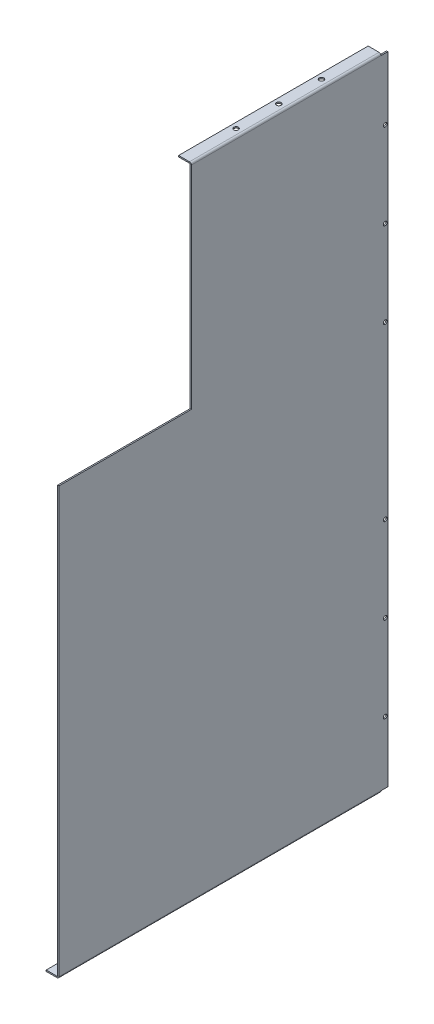
ISO-10303-21;
HEADER;
FILE_DESCRIPTION(('STEP AP214'),'2;1');
FILE_NAME('part.step','',(''),(''),'','','');
FILE_SCHEMA(('AUTOMOTIVE_DESIGN { 1 0 10303 214 1 1 1 1 }'));
ENDSEC;
DATA;
#1=APPLICATION_CONTEXT('core data for automotive mechanical design processes');
#2=APPLICATION_PROTOCOL_DEFINITION('international standard','automotive_design',2000,#1);
#3=PRODUCT_CONTEXT('',#1,'mechanical');
#4=PRODUCT('Part','Part','',(#3));
#5=PRODUCT_RELATED_PRODUCT_CATEGORY('part','',(#4));
#6=PRODUCT_DEFINITION_FORMATION('','',#4);
#7=PRODUCT_DEFINITION_CONTEXT('part definition',#1,'design');
#8=PRODUCT_DEFINITION('design','',#6,#7);
#9=PRODUCT_DEFINITION_SHAPE('','',#8);
#10=(LENGTH_UNIT() NAMED_UNIT(*) SI_UNIT(.MILLI.,.METRE.));
#11=(NAMED_UNIT(*) PLANE_ANGLE_UNIT() SI_UNIT($,.RADIAN.));
#12=(NAMED_UNIT(*) SI_UNIT($,.STERADIAN.) SOLID_ANGLE_UNIT());
#13=UNCERTAINTY_MEASURE_WITH_UNIT(LENGTH_MEASURE(1.E-05),#10,'distance_accuracy_value','');
#14=(GEOMETRIC_REPRESENTATION_CONTEXT(3) GLOBAL_UNCERTAINTY_ASSIGNED_CONTEXT((#13)) GLOBAL_UNIT_ASSIGNED_CONTEXT((#10,
#11,#12)) REPRESENTATION_CONTEXT('',''));
#15=CARTESIAN_POINT('',(0.,0.,0.));
#16=DIRECTION('',(0.,0.,1.));
#17=DIRECTION('',(1.,0.,0.));
#18=AXIS2_PLACEMENT_3D('',#15,#16,#17);
#19=CARTESIAN_POINT('',(1.5,0.,385.));
#20=DIRECTION('',(-1.,0.,0.));
#21=DIRECTION('',(0.,0.,1.));
#22=AXIS2_PLACEMENT_3D('',#19,#20,#21);
#23=PLANE('',#22);
#24=CARTESIAN_POINT('',(1.5,175.,3.));
#25=DIRECTION('',(1.,0.,0.));
#26=DIRECTION('',(0.,0.,-1.));
#27=AXIS2_PLACEMENT_3D('',#24,#25,#26);
#28=CIRCLE('',#27,2.25);
#29=CARTESIAN_POINT('',(1.5,175.,0.749999999999998));
#30=VERTEX_POINT('',#29);
#31=EDGE_CURVE('E387',#30,#30,#28,.T.);
#32=ORIENTED_EDGE('',*,*,#31,.F.);
#33=EDGE_LOOP('',(#32));
#34=FACE_BOUND('',#33,.T.);
#35=CARTESIAN_POINT('',(1.5,275.,3.));
#36=DIRECTION('',(1.,0.,0.));
#37=DIRECTION('',(0.,0.,-1.));
#38=AXIS2_PLACEMENT_3D('',#35,#36,#37);
#39=CIRCLE('',#38,2.25);
#40=CARTESIAN_POINT('',(1.5,275.,0.749999999999998));
#41=VERTEX_POINT('',#40);
#42=EDGE_CURVE('E716',#41,#41,#39,.T.);
#43=ORIENTED_EDGE('',*,*,#42,.F.);
#44=EDGE_LOOP('',(#43));
#45=FACE_BOUND('',#44,.T.);
#46=CARTESIAN_POINT('',(1.5,475.,3.));
#47=DIRECTION('',(1.,0.,0.));
#48=DIRECTION('',(0.,0.,1.));
#49=AXIS2_PLACEMENT_3D('',#46,#47,#48);
#50=CIRCLE('',#49,2.25);
#51=CARTESIAN_POINT('',(1.5,475.,5.25));
#52=VERTEX_POINT('',#51);
#53=EDGE_CURVE('E719',#52,#52,#50,.T.);
#54=ORIENTED_EDGE('',*,*,#53,.F.);
#55=EDGE_LOOP('',(#54));
#56=FACE_BOUND('',#55,.T.);
#57=CARTESIAN_POINT('',(1.5,575.,3.));
#58=DIRECTION('',(1.,0.,0.));
#59=DIRECTION('',(0.,0.,1.));
#60=AXIS2_PLACEMENT_3D('',#57,#58,#59);
#61=CIRCLE('',#60,2.24999999999998);
#62=CARTESIAN_POINT('',(1.5,575.,5.24999999999999));
#63=VERTEX_POINT('',#62);
#64=EDGE_CURVE('E724',#63,#63,#61,.T.);
#65=ORIENTED_EDGE('',*,*,#64,.F.);
#66=EDGE_LOOP('',(#65));
#67=FACE_BOUND('',#66,.T.);
#68=CARTESIAN_POINT('',(1.5,675.,3.));
#69=DIRECTION('',(1.,0.,0.));
#70=DIRECTION('',(0.,0.,1.));
#71=AXIS2_PLACEMENT_3D('',#68,#69,#70);
#72=CIRCLE('',#71,2.24999999999998);
#73=CARTESIAN_POINT('',(1.5,675.,5.24999999999999));
#74=VERTEX_POINT('',#73);
#75=EDGE_CURVE('E726',#74,#74,#72,.T.);
#76=ORIENTED_EDGE('',*,*,#75,.F.);
#77=EDGE_LOOP('',(#76));
#78=FACE_BOUND('',#77,.T.);
#79=CARTESIAN_POINT('',(1.5,75.,3.));
#80=DIRECTION('',(1.,0.,0.));
#81=DIRECTION('',(0.,0.,-1.));
#82=AXIS2_PLACEMENT_3D('',#79,#80,#81);
#83=CIRCLE('',#82,2.25);
#84=CARTESIAN_POINT('',(1.5,75.,0.749999999999999));
#85=VERTEX_POINT('',#84);
#86=EDGE_CURVE('E220',#85,#85,#83,.T.);
#87=ORIENTED_EDGE('',*,*,#86,.F.);
#88=EDGE_LOOP('',(#87));
#89=FACE_BOUND('',#88,.T.);
#90=DIRECTION('',(0.,0.,-1.));
#91=VECTOR('',#90,1.);
#92=CARTESIAN_POINT('',(1.5,500.,385.));
#93=LINE('',#92,#91);
#94=CARTESIAN_POINT('',(1.5,500.,385.));
#95=VERTEX_POINT('',#94);
#96=CARTESIAN_POINT('',(1.5,500.,230.));
#97=VERTEX_POINT('',#96);
#98=EDGE_CURVE('E209',#95,#97,#93,.T.);
#99=ORIENTED_EDGE('',*,*,#98,.F.);
#100=DIRECTION('',(0.,1.,0.));
#101=VECTOR('',#100,1.);
#102=CARTESIAN_POINT('',(1.5,0.,385.));
#103=LINE('',#102,#101);
#104=CARTESIAN_POINT('',(1.5,2.2366,385.));
#105=VERTEX_POINT('',#104);
#106=EDGE_CURVE('E363',#105,#95,#103,.T.);
#107=ORIENTED_EDGE('',*,*,#106,.F.);
#108=DIRECTION('',(0.,0.,1.));
#109=VECTOR('',#108,1.);
#110=CARTESIAN_POINT('',(1.5,2.2366,385.));
#111=LINE('',#110,#109);
#112=CARTESIAN_POINT('',(1.5,2.2366,8.00000000000001));
#113=VERTEX_POINT('',#112);
#114=EDGE_CURVE('E325',#105,#113,#111,.F.);
#115=ORIENTED_EDGE('',*,*,#114,.T.);
#116=DIRECTION('',(0.,0.,1.));
#117=VECTOR('',#116,1.);
#118=CARTESIAN_POINT('',(1.5,2.2366,385.));
#119=LINE('',#118,#117);
#120=CARTESIAN_POINT('',(1.5,2.2366,0.));
#121=VERTEX_POINT('',#120);
#122=EDGE_CURVE('E271',#113,#121,#119,.F.);
#123=ORIENTED_EDGE('',*,*,#122,.T.);
#124=DIRECTION('',(0.,1.,0.));
#125=VECTOR('',#124,1.);
#126=CARTESIAN_POINT('',(1.5,0.,0.));
#127=LINE('',#126,#125);
#128=CARTESIAN_POINT('',(1.5,747.7634,0.));
#129=VERTEX_POINT('',#128);
#130=EDGE_CURVE('E362',#121,#129,#127,.T.);
#131=ORIENTED_EDGE('',*,*,#130,.T.);
#132=DIRECTION('',(0.,0.,-1.));
#133=VECTOR('',#132,1.);
#134=CARTESIAN_POINT('',(1.5,747.7634,0.));
#135=LINE('',#134,#133);
#136=CARTESIAN_POINT('',(1.50000000000007,747.7634,7.99999999999999));
#137=VERTEX_POINT('',#136);
#138=EDGE_CURVE('E353',#129,#137,#135,.F.);
#139=ORIENTED_EDGE('',*,*,#138,.T.);
#140=CARTESIAN_POINT('',(1.5,747.7634,230.));
#141=VERTEX_POINT('',#140);
#142=EDGE_CURVE('E357',#137,#141,#135,.F.);
#143=ORIENTED_EDGE('',*,*,#142,.T.);
#144=DIRECTION('',(0.,-1.,0.));
#145=VECTOR('',#144,1.);
#146=CARTESIAN_POINT('',(1.5,0.,230.));
#147=LINE('',#146,#145);
#148=EDGE_CURVE('E268',#141,#97,#147,.T.);
#149=ORIENTED_EDGE('',*,*,#148,.T.);
#150=EDGE_LOOP('',(#99,#107,#115,#123,#131,#139,#143,#149));
#151=FACE_BOUND('',#150,.T.);
#152=ADVANCED_FACE('F77',(#34,#45,#56,#67,#78,#89,#151),#23,.F.);
#153=CARTESIAN_POINT('',(0.,0.,385.));
#154=DIRECTION('',(-1.,0.,0.));
#155=DIRECTION('',(0.,0.,1.));
#156=AXIS2_PLACEMENT_3D('',#153,#154,#155);
#157=PLANE('',#156);
#158=CARTESIAN_POINT('',(0.,175.,3.));
#159=DIRECTION('',(-1.,0.,0.));
#160=DIRECTION('',(0.,0.,1.));
#161=AXIS2_PLACEMENT_3D('',#158,#159,#160);
#162=CIRCLE('',#161,2.25);
#163=CARTESIAN_POINT('',(0.,175.,5.25));
#164=VERTEX_POINT('',#163);
#165=EDGE_CURVE('E80',#164,#164,#162,.T.);
#166=ORIENTED_EDGE('',*,*,#165,.F.);
#167=EDGE_LOOP('',(#166));
#168=FACE_BOUND('',#167,.T.);
#169=CARTESIAN_POINT('',(0.,275.,3.));
#170=DIRECTION('',(-1.,0.,0.));
#171=DIRECTION('',(0.,0.,1.));
#172=AXIS2_PLACEMENT_3D('',#169,#170,#171);
#173=CIRCLE('',#172,2.25);
#174=CARTESIAN_POINT('',(0.,275.,5.25));
#175=VERTEX_POINT('',#174);
#176=EDGE_CURVE('E392',#175,#175,#173,.T.);
#177=ORIENTED_EDGE('',*,*,#176,.F.);
#178=EDGE_LOOP('',(#177));
#179=FACE_BOUND('',#178,.T.);
#180=CARTESIAN_POINT('',(0.,475.,3.));
#181=DIRECTION('',(-1.,0.,0.));
#182=DIRECTION('',(0.,0.,1.));
#183=AXIS2_PLACEMENT_3D('',#180,#181,#182);
#184=CIRCLE('',#183,2.25);
#185=CARTESIAN_POINT('',(0.,475.,5.25));
#186=VERTEX_POINT('',#185);
#187=EDGE_CURVE('E390',#186,#186,#184,.T.);
#188=ORIENTED_EDGE('',*,*,#187,.F.);
#189=EDGE_LOOP('',(#188));
#190=FACE_BOUND('',#189,.T.);
#191=CARTESIAN_POINT('',(0.,575.,3.));
#192=DIRECTION('',(-1.,0.,0.));
#193=DIRECTION('',(0.,0.,1.));
#194=AXIS2_PLACEMENT_3D('',#191,#192,#193);
#195=CIRCLE('',#194,2.24999999999998);
#196=CARTESIAN_POINT('',(0.,575.,5.24999999999999));
#197=VERTEX_POINT('',#196);
#198=EDGE_CURVE('E386',#197,#197,#195,.T.);
#199=ORIENTED_EDGE('',*,*,#198,.F.);
#200=EDGE_LOOP('',(#199));
#201=FACE_BOUND('',#200,.T.);
#202=CARTESIAN_POINT('',(0.,675.,3.));
#203=DIRECTION('',(-1.,0.,0.));
#204=DIRECTION('',(0.,0.,1.));
#205=AXIS2_PLACEMENT_3D('',#202,#203,#204);
#206=CIRCLE('',#205,2.24999999999998);
#207=CARTESIAN_POINT('',(0.,675.,5.24999999999999));
#208=VERTEX_POINT('',#207);
#209=EDGE_CURVE('E383',#208,#208,#206,.T.);
#210=ORIENTED_EDGE('',*,*,#209,.F.);
#211=EDGE_LOOP('',(#210));
#212=FACE_BOUND('',#211,.T.);
#213=CARTESIAN_POINT('',(0.,75.,3.));
#214=DIRECTION('',(-1.,0.,0.));
#215=DIRECTION('',(0.,0.,1.));
#216=AXIS2_PLACEMENT_3D('',#213,#214,#215);
#217=CIRCLE('',#216,2.25);
#218=CARTESIAN_POINT('',(0.,75.,5.25));
#219=VERTEX_POINT('',#218);
#220=EDGE_CURVE('E217',#219,#219,#217,.T.);
#221=ORIENTED_EDGE('',*,*,#220,.F.);
#222=EDGE_LOOP('',(#221));
#223=FACE_BOUND('',#222,.T.);
#224=DIRECTION('',(0.,1.,0.));
#225=VECTOR('',#224,1.);
#226=CARTESIAN_POINT('',(0.,0.,385.));
#227=LINE('',#226,#225);
#228=CARTESIAN_POINT('',(0.,2.2366,385.));
#229=VERTEX_POINT('',#228);
#230=CARTESIAN_POINT('',(0.,500.,385.));
#231=VERTEX_POINT('',#230);
#232=EDGE_CURVE('E215',#229,#231,#227,.T.);
#233=ORIENTED_EDGE('',*,*,#232,.T.);
#234=DIRECTION('',(0.,0.,1.));
#235=VECTOR('',#234,1.);
#236=CARTESIAN_POINT('',(0.,500.,385.));
#237=LINE('',#236,#235);
#238=CARTESIAN_POINT('',(0.,500.,230.));
#239=VERTEX_POINT('',#238);
#240=EDGE_CURVE('E206',#231,#239,#237,.F.);
#241=ORIENTED_EDGE('',*,*,#240,.T.);
#242=DIRECTION('',(0.,-1.,0.));
#243=VECTOR('',#242,1.);
#244=CARTESIAN_POINT('',(0.,0.,230.));
#245=LINE('',#244,#243);
#246=CARTESIAN_POINT('',(0.,747.7634,230.));
#247=VERTEX_POINT('',#246);
#248=EDGE_CURVE('E190',#247,#239,#245,.T.);
#249=ORIENTED_EDGE('',*,*,#248,.F.);
#250=DIRECTION('',(0.,0.,-1.));
#251=VECTOR('',#250,1.);
#252=CARTESIAN_POINT('',(0.,747.7634,0.));
#253=LINE('',#252,#251);
#254=CARTESIAN_POINT('',(0.,747.7634,8.));
#255=VERTEX_POINT('',#254);
#256=EDGE_CURVE('E345',#255,#247,#253,.F.);
#257=ORIENTED_EDGE('',*,*,#256,.F.);
#258=CARTESIAN_POINT('',(0.,747.7634,0.));
#259=VERTEX_POINT('',#258);
#260=EDGE_CURVE('E358',#259,#255,#253,.F.);
#261=ORIENTED_EDGE('',*,*,#260,.F.);
#262=DIRECTION('',(0.,1.,0.));
#263=VECTOR('',#262,1.);
#264=CARTESIAN_POINT('',(0.,0.,0.));
#265=LINE('',#264,#263);
#266=CARTESIAN_POINT('',(0.,2.2366,0.));
#267=VERTEX_POINT('',#266);
#268=EDGE_CURVE('E366',#267,#259,#265,.T.);
#269=ORIENTED_EDGE('',*,*,#268,.F.);
#270=DIRECTION('',(0.,0.,-1.));
#271=VECTOR('',#270,1.);
#272=CARTESIAN_POINT('',(0.,2.2366,8.));
#273=LINE('',#272,#271);
#274=CARTESIAN_POINT('',(0.,2.2366,8.));
#275=VERTEX_POINT('',#274);
#276=EDGE_CURVE('E270',#275,#267,#273,.T.);
#277=ORIENTED_EDGE('',*,*,#276,.F.);
#278=DIRECTION('',(0.,0.,1.));
#279=VECTOR('',#278,1.);
#280=CARTESIAN_POINT('',(0.,2.2366,385.));
#281=LINE('',#280,#279);
#282=EDGE_CURVE('E332',#229,#275,#281,.F.);
#283=ORIENTED_EDGE('',*,*,#282,.F.);
#284=EDGE_LOOP('',(#233,#241,#249,#257,#261,#269,#277,#283));
#285=FACE_BOUND('',#284,.T.);
#286=ADVANCED_FACE('F213',(#168,#179,#190,#201,#212,#223,#285),#157,.T.);
#287=CARTESIAN_POINT('',(0.,0.,385.));
#288=DIRECTION('',(0.,0.,-1.));
#289=DIRECTION('',(-1.,0.,0.));
#290=AXIS2_PLACEMENT_3D('',#287,#288,#289);
#291=PLANE('',#290);
#292=DIRECTION('',(1.,0.,0.));
#293=VECTOR('',#292,1.);
#294=CARTESIAN_POINT('',(1.5,500.,385.));
#295=LINE('',#294,#293);
#296=EDGE_CURVE('E210',#95,#231,#295,.F.);
#297=ORIENTED_EDGE('',*,*,#296,.T.);
#298=ORIENTED_EDGE('',*,*,#232,.F.);
#299=DIRECTION('',(1.,0.,0.));
#300=VECTOR('',#299,1.);
#301=CARTESIAN_POINT('',(0.,2.2366,385.));
#302=LINE('',#301,#300);
#303=EDGE_CURVE('E328',#229,#105,#302,.T.);
#304=ORIENTED_EDGE('',*,*,#303,.T.);
#305=ORIENTED_EDGE('',*,*,#106,.T.);
#306=EDGE_LOOP('',(#297,#298,#304,#305));
#307=FACE_BOUND('',#306,.T.);
#308=ADVANCED_FACE('F409',(#307),#291,.F.);
#309=CARTESIAN_POINT('',(-13.5,501.5,230.));
#310=DIRECTION('',(0.,0.,-1.));
#311=DIRECTION('',(-1.,0.,0.));
#312=AXIS2_PLACEMENT_3D('',#309,#310,#311);
#313=PLANE('',#312);
#314=DIRECTION('',(1.,0.,0.));
#315=VECTOR('',#314,1.);
#316=CARTESIAN_POINT('',(0.,748.5,230.));
#317=LINE('',#316,#315);
#318=CARTESIAN_POINT('',(-13.5,748.5,230.));
#319=VERTEX_POINT('',#318);
#320=CARTESIAN_POINT('',(-0.736599999999976,748.5,230.));
#321=VERTEX_POINT('',#320);
#322=EDGE_CURVE('E261',#319,#321,#317,.T.);
#323=ORIENTED_EDGE('',*,*,#322,.T.);
#324=DIRECTION('',(0.,1.,0.));
#325=VECTOR('',#324,1.);
#326=CARTESIAN_POINT('',(-0.736599999999976,748.5,230.));
#327=LINE('',#326,#325);
#328=CARTESIAN_POINT('',(-0.736599999999976,750.,230.));
#329=VERTEX_POINT('',#328);
#330=EDGE_CURVE('E13',#321,#329,#327,.T.);
#331=ORIENTED_EDGE('',*,*,#330,.T.);
#332=DIRECTION('',(-1.,0.,0.));
#333=VECTOR('',#332,1.);
#334=CARTESIAN_POINT('',(-13.5,750.,230.));
#335=LINE('',#334,#333);
#336=CARTESIAN_POINT('',(-13.5,750.,230.));
#337=VERTEX_POINT('',#336);
#338=EDGE_CURVE('E92',#329,#337,#335,.T.);
#339=ORIENTED_EDGE('',*,*,#338,.T.);
#340=DIRECTION('',(0.,1.,0.));
#341=VECTOR('',#340,1.);
#342=CARTESIAN_POINT('',(-13.5,750.,230.));
#343=LINE('',#342,#341);
#344=EDGE_CURVE('E378',#319,#337,#343,.T.);
#345=ORIENTED_EDGE('',*,*,#344,.F.);
#346=EDGE_LOOP('',(#323,#331,#339,#345));
#347=FACE_BOUND('',#346,.T.);
#348=ADVANCED_FACE('F473',(#347),#313,.F.);
#349=ORIENTED_EDGE('',*,*,#148,.F.);
#350=DIRECTION('',(-1.,0.,0.));
#351=VECTOR('',#350,1.);
#352=CARTESIAN_POINT('',(1.5,747.7634,230.));
#353=LINE('',#352,#351);
#354=EDGE_CURVE('E85',#141,#247,#353,.T.);
#355=ORIENTED_EDGE('',*,*,#354,.T.);
#356=ORIENTED_EDGE('',*,*,#248,.T.);
#357=DIRECTION('',(1.,0.,0.));
#358=VECTOR('',#357,1.);
#359=CARTESIAN_POINT('',(1.5,500.,230.));
#360=LINE('',#359,#358);
#361=EDGE_CURVE('E194',#97,#239,#360,.F.);
#362=ORIENTED_EDGE('',*,*,#361,.F.);
#363=EDGE_LOOP('',(#349,#355,#356,#362));
#364=FACE_BOUND('',#363,.T.);
#365=ADVANCED_FACE('F193',(#364),#313,.F.);
#366=CARTESIAN_POINT('',(-0.7366,2.2366,385.));
#367=DIRECTION('',(0.,0.,1.));
#368=DIRECTION('',(0.,-1.,0.));
#369=AXIS2_PLACEMENT_3D('',#366,#367,#368);
#370=CYLINDRICAL_SURFACE('',#369,2.2366);
#371=DIRECTION('',(0.,0.,1.));
#372=VECTOR('',#371,1.);
#373=CARTESIAN_POINT('',(-0.736599999999992,0.,0.));
#374=LINE('',#373,#372);
#375=CARTESIAN_POINT('',(-0.736599999999992,0.,8.));
#376=VERTEX_POINT('',#375);
#377=CARTESIAN_POINT('',(-0.736599999999992,0.,385.));
#378=VERTEX_POINT('',#377);
#379=EDGE_CURVE('E319',#376,#378,#374,.T.);
#380=ORIENTED_EDGE('',*,*,#379,.F.);
#381=CARTESIAN_POINT('',(-0.7366,2.2366,8.00000000000001));
#382=DIRECTION('',(0.,0.,-1.));
#383=DIRECTION('',(-1.,0.,0.));
#384=AXIS2_PLACEMENT_3D('',#381,#382,#383);
#385=CIRCLE('',#384,2.2366);
#386=EDGE_CURVE('E278',#376,#113,#385,.F.);
#387=ORIENTED_EDGE('',*,*,#386,.T.);
#388=ORIENTED_EDGE('',*,*,#114,.F.);
#389=CARTESIAN_POINT('',(-0.7366,2.2366,385.));
#390=DIRECTION('',(0.,0.,1.));
#391=DIRECTION('',(1.,0.,0.));
#392=AXIS2_PLACEMENT_3D('',#389,#390,#391);
#393=CIRCLE('',#392,2.2366);
#394=EDGE_CURVE('E329',#378,#105,#393,.T.);
#395=ORIENTED_EDGE('',*,*,#394,.F.);
#396=EDGE_LOOP('',(#380,#387,#388,#395));
#397=FACE_BOUND('',#396,.T.);
#398=ADVANCED_FACE('F417',(#397),#370,.T.);
#399=CARTESIAN_POINT('',(-0.7366,2.2366,385.));
#400=DIRECTION('',(0.,0.,1.));
#401=DIRECTION('',(0.,-1.,0.));
#402=AXIS2_PLACEMENT_3D('',#399,#400,#401);
#403=CYLINDRICAL_SURFACE('',#402,0.7366);
#404=CARTESIAN_POINT('',(-0.7366,2.2366,8.00000000000001));
#405=DIRECTION('',(0.,0.,1.));
#406=DIRECTION('',(1.,0.,0.));
#407=AXIS2_PLACEMENT_3D('',#404,#405,#406);
#408=CIRCLE('',#407,0.7366);
#409=CARTESIAN_POINT('',(-0.736599999999997,1.5,8.00000000000001));
#410=VERTEX_POINT('',#409);
#411=EDGE_CURVE('E279',#410,#275,#408,.T.);
#412=ORIENTED_EDGE('',*,*,#411,.F.);
#413=DIRECTION('',(0.,0.,-1.));
#414=VECTOR('',#413,1.);
#415=CARTESIAN_POINT('',(-0.736599999999997,1.5,0.));
#416=LINE('',#415,#414);
#417=CARTESIAN_POINT('',(-0.736599999999997,1.5,385.));
#418=VERTEX_POINT('',#417);
#419=EDGE_CURVE('E304',#410,#418,#416,.F.);
#420=ORIENTED_EDGE('',*,*,#419,.T.);
#421=CARTESIAN_POINT('',(-0.7366,2.2366,385.));
#422=DIRECTION('',(0.,0.,1.));
#423=DIRECTION('',(1.,0.,0.));
#424=AXIS2_PLACEMENT_3D('',#421,#422,#423);
#425=CIRCLE('',#424,0.7366);
#426=EDGE_CURVE('E308',#418,#229,#425,.T.);
#427=ORIENTED_EDGE('',*,*,#426,.T.);
#428=ORIENTED_EDGE('',*,*,#282,.T.);
#429=EDGE_LOOP('',(#412,#420,#427,#428));
#430=FACE_BOUND('',#429,.T.);
#431=ADVANCED_FACE('F439',(#430),#403,.F.);
#432=CARTESIAN_POINT('',(0.,0.,0.));
#433=DIRECTION('',(0.,-1.,0.));
#434=DIRECTION('',(1.,0.,0.));
#435=AXIS2_PLACEMENT_3D('',#432,#433,#434);
#436=PLANE('',#435);
#437=CARTESIAN_POINT('',(-7.1183,0.,196.5));
#438=DIRECTION('',(0.,-1.,0.));
#439=DIRECTION('',(1.,0.,0.));
#440=AXIS2_PLACEMENT_3D('',#437,#438,#439);
#441=CIRCLE('',#440,2.75);
#442=CARTESIAN_POINT('',(-4.3683,0.,196.5));
#443=VERTEX_POINT('',#442);
#444=EDGE_CURVE('E251',#443,#443,#441,.T.);
#445=ORIENTED_EDGE('',*,*,#444,.F.);
#446=EDGE_LOOP('',(#445));
#447=FACE_BOUND('',#446,.T.);
#448=CARTESIAN_POINT('',(-7.11829999999998,0.,96.5));
#449=DIRECTION('',(0.,-1.,0.));
#450=DIRECTION('',(1.,0.,0.));
#451=AXIS2_PLACEMENT_3D('',#448,#449,#450);
#452=CIRCLE('',#451,2.75);
#453=CARTESIAN_POINT('',(-4.36829999999998,0.,96.5));
#454=VERTEX_POINT('',#453);
#455=EDGE_CURVE('E246',#454,#454,#452,.T.);
#456=ORIENTED_EDGE('',*,*,#455,.F.);
#457=EDGE_LOOP('',(#456));
#458=FACE_BOUND('',#457,.T.);
#459=CARTESIAN_POINT('',(-7.11829999999996,0.,296.5));
#460=DIRECTION('',(0.,-1.,0.));
#461=DIRECTION('',(1.,0.,0.));
#462=AXIS2_PLACEMENT_3D('',#459,#460,#461);
#463=CIRCLE('',#462,2.75);
#464=CARTESIAN_POINT('',(-4.36829999999996,0.,296.5));
#465=VERTEX_POINT('',#464);
#466=EDGE_CURVE('E257',#465,#465,#463,.T.);
#467=ORIENTED_EDGE('',*,*,#466,.F.);
#468=EDGE_LOOP('',(#467));
#469=FACE_BOUND('',#468,.T.);
#470=DIRECTION('',(0.,0.,1.));
#471=VECTOR('',#470,1.);
#472=CARTESIAN_POINT('',(-13.5,0.,385.));
#473=LINE('',#472,#471);
#474=CARTESIAN_POINT('',(-13.5,0.,8.00000000000001));
#475=VERTEX_POINT('',#474);
#476=CARTESIAN_POINT('',(-13.5,0.,385.));
#477=VERTEX_POINT('',#476);
#478=EDGE_CURVE('E312',#475,#477,#473,.T.);
#479=ORIENTED_EDGE('',*,*,#478,.F.);
#480=DIRECTION('',(1.,0.,0.));
#481=VECTOR('',#480,1.);
#482=CARTESIAN_POINT('',(0.,0.,8.));
#483=LINE('',#482,#481);
#484=EDGE_CURVE('E100',#475,#376,#483,.T.);
#485=ORIENTED_EDGE('',*,*,#484,.T.);
#486=ORIENTED_EDGE('',*,*,#379,.T.);
#487=DIRECTION('',(1.,0.,0.));
#488=VECTOR('',#487,1.);
#489=CARTESIAN_POINT('',(0.,0.,385.));
#490=LINE('',#489,#488);
#491=EDGE_CURVE('E309',#477,#378,#490,.T.);
#492=ORIENTED_EDGE('',*,*,#491,.F.);
#493=EDGE_LOOP('',(#479,#485,#486,#492));
#494=FACE_BOUND('',#493,.T.);
#495=ADVANCED_FACE('F428',(#447,#458,#469,#494),#436,.T.);
#496=CARTESIAN_POINT('',(0.,1.5,0.));
#497=DIRECTION('',(0.,-1.,0.));
#498=DIRECTION('',(1.,0.,0.));
#499=AXIS2_PLACEMENT_3D('',#496,#497,#498);
#500=PLANE('',#499);
#501=CARTESIAN_POINT('',(-7.1183,1.49999999999998,196.5));
#502=DIRECTION('',(0.,1.,0.));
#503=DIRECTION('',(-1.,0.,0.));
#504=AXIS2_PLACEMENT_3D('',#501,#502,#503);
#505=CIRCLE('',#504,2.75);
#506=CARTESIAN_POINT('',(-9.8683,1.49999999999997,196.5));
#507=VERTEX_POINT('',#506);
#508=EDGE_CURVE('E243',#507,#507,#505,.T.);
#509=ORIENTED_EDGE('',*,*,#508,.F.);
#510=EDGE_LOOP('',(#509));
#511=FACE_BOUND('',#510,.T.);
#512=CARTESIAN_POINT('',(-7.11829999999999,1.49999999999998,96.5));
#513=DIRECTION('',(0.,1.,0.));
#514=DIRECTION('',(1.,0.,0.));
#515=AXIS2_PLACEMENT_3D('',#512,#513,#514);
#516=CIRCLE('',#515,2.75);
#517=CARTESIAN_POINT('',(-4.36829999999999,1.49999999999998,96.5));
#518=VERTEX_POINT('',#517);
#519=EDGE_CURVE('E242',#518,#518,#516,.T.);
#520=ORIENTED_EDGE('',*,*,#519,.F.);
#521=EDGE_LOOP('',(#520));
#522=FACE_BOUND('',#521,.T.);
#523=CARTESIAN_POINT('',(-7.11829999999997,1.49999999999998,296.5));
#524=DIRECTION('',(0.,1.,0.));
#525=DIRECTION('',(-1.,0.,0.));
#526=AXIS2_PLACEMENT_3D('',#523,#524,#525);
#527=CIRCLE('',#526,2.75);
#528=CARTESIAN_POINT('',(-9.86829999999997,1.49999999999997,296.5));
#529=VERTEX_POINT('',#528);
#530=EDGE_CURVE('E254',#529,#529,#527,.T.);
#531=ORIENTED_EDGE('',*,*,#530,.F.);
#532=EDGE_LOOP('',(#531));
#533=FACE_BOUND('',#532,.T.);
#534=DIRECTION('',(1.,0.,0.));
#535=VECTOR('',#534,1.);
#536=CARTESIAN_POINT('',(0.,1.5,8.00000000000001));
#537=LINE('',#536,#535);
#538=CARTESIAN_POINT('',(-13.5,1.49999999999995,8.00000000000001));
#539=VERTEX_POINT('',#538);
#540=EDGE_CURVE('E283',#539,#410,#537,.T.);
#541=ORIENTED_EDGE('',*,*,#540,.F.);
#542=DIRECTION('',(0.,0.,-1.));
#543=VECTOR('',#542,1.);
#544=CARTESIAN_POINT('',(-13.5,1.49999999999995,0.));
#545=LINE('',#544,#543);
#546=CARTESIAN_POINT('',(-13.5,1.49999999999995,385.));
#547=VERTEX_POINT('',#546);
#548=EDGE_CURVE('E317',#539,#547,#545,.F.);
#549=ORIENTED_EDGE('',*,*,#548,.T.);
#550=DIRECTION('',(-1.,0.,0.));
#551=VECTOR('',#550,1.);
#552=CARTESIAN_POINT('',(0.,1.5,385.));
#553=LINE('',#552,#551);
#554=EDGE_CURVE('E314',#547,#418,#553,.F.);
#555=ORIENTED_EDGE('',*,*,#554,.T.);
#556=ORIENTED_EDGE('',*,*,#419,.F.);
#557=EDGE_LOOP('',(#541,#549,#555,#556));
#558=FACE_BOUND('',#557,.T.);
#559=ADVANCED_FACE('F436',(#511,#522,#533,#558),#500,.F.);
#560=CARTESIAN_POINT('',(-13.5,0.,385.));
#561=DIRECTION('',(-1.,0.,0.));
#562=DIRECTION('',(0.,-1.,0.));
#563=AXIS2_PLACEMENT_3D('',#560,#561,#562);
#564=PLANE('',#563);
#565=ORIENTED_EDGE('',*,*,#548,.F.);
#566=DIRECTION('',(0.,-1.,0.));
#567=VECTOR('',#566,1.);
#568=CARTESIAN_POINT('',(-13.5,0.,8.00000000000001));
#569=LINE('',#568,#567);
#570=EDGE_CURVE('E285',#475,#539,#569,.F.);
#571=ORIENTED_EDGE('',*,*,#570,.F.);
#572=ORIENTED_EDGE('',*,*,#478,.T.);
#573=DIRECTION('',(0.,1.,0.));
#574=VECTOR('',#573,1.);
#575=CARTESIAN_POINT('',(-13.5,0.,385.));
#576=LINE('',#575,#574);
#577=EDGE_CURVE('E305',#477,#547,#576,.T.);
#578=ORIENTED_EDGE('',*,*,#577,.T.);
#579=EDGE_LOOP('',(#565,#571,#572,#578));
#580=FACE_BOUND('',#579,.T.);
#581=ADVANCED_FACE('F431',(#580),#564,.T.);
#582=CARTESIAN_POINT('',(0.,0.,8.));
#583=DIRECTION('',(0.,0.,1.));
#584=DIRECTION('',(1.,0.,0.));
#585=AXIS2_PLACEMENT_3D('',#582,#583,#584);
#586=PLANE('',#585);
#587=DIRECTION('',(-1.,0.,0.));
#588=VECTOR('',#587,1.);
#589=CARTESIAN_POINT('',(0.,750.,8.));
#590=LINE('',#589,#588);
#591=CARTESIAN_POINT('',(-0.736599999999976,750.,8.00000000000001));
#592=VERTEX_POINT('',#591);
#593=CARTESIAN_POINT('',(-13.5,750.,8.00000000000012));
#594=VERTEX_POINT('',#593);
#595=EDGE_CURVE('E296',#592,#594,#590,.T.);
#596=ORIENTED_EDGE('',*,*,#595,.F.);
#597=DIRECTION('',(0.,-1.,0.));
#598=VECTOR('',#597,1.);
#599=CARTESIAN_POINT('',(-0.736599999999976,750.,8.00000000000001));
#600=LINE('',#599,#598);
#601=CARTESIAN_POINT('',(-0.736599999999976,748.5,8.00000000000001));
#602=VERTEX_POINT('',#601);
#603=EDGE_CURVE('E375',#592,#602,#600,.T.);
#604=ORIENTED_EDGE('',*,*,#603,.T.);
#605=DIRECTION('',(-1.,0.,0.));
#606=VECTOR('',#605,1.);
#607=CARTESIAN_POINT('',(0.,748.5,8.));
#608=LINE('',#607,#606);
#609=CARTESIAN_POINT('',(-13.5,748.5,8.00000000000012));
#610=VERTEX_POINT('',#609);
#611=EDGE_CURVE('E294',#602,#610,#608,.T.);
#612=ORIENTED_EDGE('',*,*,#611,.T.);
#613=DIRECTION('',(0.,-1.,0.));
#614=VECTOR('',#613,1.);
#615=CARTESIAN_POINT('',(-13.5,750.,8.00000000000012));
#616=LINE('',#615,#614);
#617=EDGE_CURVE('E368',#594,#610,#616,.T.);
#618=ORIENTED_EDGE('',*,*,#617,.F.);
#619=EDGE_LOOP('',(#596,#604,#612,#618));
#620=FACE_BOUND('',#619,.T.);
#621=ADVANCED_FACE('F481',(#620),#586,.F.);
#622=CARTESIAN_POINT('',(0.,0.,0.));
#623=DIRECTION('',(0.,0.,-1.));
#624=DIRECTION('',(-1.,0.,0.));
#625=AXIS2_PLACEMENT_3D('',#622,#623,#624);
#626=PLANE('',#625);
#627=DIRECTION('',(1.,0.,0.));
#628=VECTOR('',#627,1.);
#629=CARTESIAN_POINT('',(0.,2.2366,0.));
#630=LINE('',#629,#628);
#631=EDGE_CURVE('E337',#267,#121,#630,.T.);
#632=ORIENTED_EDGE('',*,*,#631,.F.);
#633=ORIENTED_EDGE('',*,*,#268,.T.);
#634=DIRECTION('',(1.,0.,0.));
#635=VECTOR('',#634,1.);
#636=CARTESIAN_POINT('',(0.,747.7634,0.));
#637=LINE('',#636,#635);
#638=EDGE_CURVE('E356',#259,#129,#637,.T.);
#639=ORIENTED_EDGE('',*,*,#638,.T.);
#640=ORIENTED_EDGE('',*,*,#130,.F.);
#641=EDGE_LOOP('',(#632,#633,#639,#640));
#642=FACE_BOUND('',#641,.T.);
#643=ADVANCED_FACE('F450',(#642),#626,.T.);
#644=CARTESIAN_POINT('',(-0.736599999999976,747.7634,0.));
#645=DIRECTION('',(0.,0.,-1.));
#646=DIRECTION('',(0.,1.,0.));
#647=AXIS2_PLACEMENT_3D('',#644,#645,#646);
#648=CYLINDRICAL_SURFACE('',#647,2.23659999999998);
#649=CARTESIAN_POINT('',(-0.736599999999976,747.7634,230.));
#650=DIRECTION('',(0.,0.,-1.));
#651=DIRECTION('',(-1.,0.,0.));
#652=AXIS2_PLACEMENT_3D('',#649,#650,#651);
#653=CIRCLE('',#652,2.23659999999998);
#654=EDGE_CURVE('E200',#141,#329,#653,.F.);
#655=ORIENTED_EDGE('',*,*,#654,.F.);
#656=ORIENTED_EDGE('',*,*,#142,.F.);
#657=CARTESIAN_POINT('',(-0.736599999999976,747.7634,8.00000000000001));
#658=DIRECTION('',(0.,0.,1.));
#659=DIRECTION('',(1.,0.,0.));
#660=AXIS2_PLACEMENT_3D('',#657,#658,#659);
#661=CIRCLE('',#660,2.23659999999998);
#662=EDGE_CURVE('E302',#592,#137,#661,.F.);
#663=ORIENTED_EDGE('',*,*,#662,.F.);
#664=DIRECTION('',(0.,0.,-1.));
#665=VECTOR('',#664,1.);
#666=CARTESIAN_POINT('',(-0.736599999999976,750.,385.));
#667=LINE('',#666,#665);
#668=EDGE_CURVE('E349',#592,#329,#667,.F.);
#669=ORIENTED_EDGE('',*,*,#668,.T.);
#670=EDGE_LOOP('',(#655,#656,#663,#669));
#671=FACE_BOUND('',#670,.T.);
#672=ADVANCED_FACE('F461',(#671),#648,.T.);
#673=CARTESIAN_POINT('',(-0.736599999999976,747.7634,0.));
#674=DIRECTION('',(0.,0.,-1.));
#675=DIRECTION('',(0.,1.,0.));
#676=AXIS2_PLACEMENT_3D('',#673,#674,#675);
#677=CYLINDRICAL_SURFACE('',#676,0.736599999999976);
#678=ORIENTED_EDGE('',*,*,#256,.T.);
#679=CARTESIAN_POINT('',(-0.736599999999976,747.7634,230.));
#680=DIRECTION('',(0.,0.,-1.));
#681=DIRECTION('',(-1.,0.,0.));
#682=AXIS2_PLACEMENT_3D('',#679,#680,#681);
#683=CIRCLE('',#682,0.736599999999976);
#684=EDGE_CURVE('E201',#247,#321,#683,.F.);
#685=ORIENTED_EDGE('',*,*,#684,.T.);
#686=DIRECTION('',(0.,0.,-1.));
#687=VECTOR('',#686,1.);
#688=CARTESIAN_POINT('',(-0.736599999999976,748.5,385.));
#689=LINE('',#688,#687);
#690=EDGE_CURVE('E339',#321,#602,#689,.T.);
#691=ORIENTED_EDGE('',*,*,#690,.T.);
#692=CARTESIAN_POINT('',(-0.736599999999976,747.7634,8.00000000000001));
#693=DIRECTION('',(0.,0.,1.));
#694=DIRECTION('',(1.,0.,0.));
#695=AXIS2_PLACEMENT_3D('',#692,#693,#694);
#696=CIRCLE('',#695,0.736599999999976);
#697=EDGE_CURVE('E299',#602,#255,#696,.F.);
#698=ORIENTED_EDGE('',*,*,#697,.T.);
#699=EDGE_LOOP('',(#678,#685,#691,#698));
#700=FACE_BOUND('',#699,.T.);
#701=ADVANCED_FACE('F479',(#700),#677,.F.);
#702=CARTESIAN_POINT('',(0.,750.,0.));
#703=DIRECTION('',(0.,-1.,0.));
#704=DIRECTION('',(0.,0.,-1.));
#705=AXIS2_PLACEMENT_3D('',#702,#703,#704);
#706=PLANE('',#705);
#707=CARTESIAN_POINT('',(-7.11829999999999,750.,119.));
#708=DIRECTION('',(0.,-1.,0.));
#709=DIRECTION('',(0.,0.,-1.));
#710=AXIS2_PLACEMENT_3D('',#707,#708,#709);
#711=CIRCLE('',#710,2.75);
#712=CARTESIAN_POINT('',(-7.11829999999999,750.,116.25));
#713=VERTEX_POINT('',#712);
#714=EDGE_CURVE('E233',#713,#713,#711,.T.);
#715=ORIENTED_EDGE('',*,*,#714,.T.);
#716=EDGE_LOOP('',(#715));
#717=FACE_BOUND('',#716,.T.);
#718=CARTESIAN_POINT('',(-7.1183,750.,169.));
#719=DIRECTION('',(0.,-1.,0.));
#720=DIRECTION('',(0.,0.,-1.));
#721=AXIS2_PLACEMENT_3D('',#718,#719,#720);
#722=CIRCLE('',#721,2.75);
#723=CARTESIAN_POINT('',(-7.1183,750.,166.25));
#724=VERTEX_POINT('',#723);
#725=EDGE_CURVE('E228',#724,#724,#722,.T.);
#726=ORIENTED_EDGE('',*,*,#725,.T.);
#727=EDGE_LOOP('',(#726));
#728=FACE_BOUND('',#727,.T.);
#729=CARTESIAN_POINT('',(-7.11829999999999,750.,69.0000000000001));
#730=DIRECTION('',(0.,-1.,0.));
#731=DIRECTION('',(0.,0.,-1.));
#732=AXIS2_PLACEMENT_3D('',#729,#730,#731);
#733=CIRCLE('',#732,2.75);
#734=CARTESIAN_POINT('',(-7.11829999999999,750.,66.2500000000001));
#735=VERTEX_POINT('',#734);
#736=EDGE_CURVE('E239',#735,#735,#733,.T.);
#737=ORIENTED_EDGE('',*,*,#736,.T.);
#738=EDGE_LOOP('',(#737));
#739=FACE_BOUND('',#738,.T.);
#740=DIRECTION('',(0.,0.,1.));
#741=VECTOR('',#740,1.);
#742=CARTESIAN_POINT('',(-13.5,750.,0.));
#743=LINE('',#742,#741);
#744=EDGE_CURVE('E342',#594,#337,#743,.T.);
#745=ORIENTED_EDGE('',*,*,#744,.T.);
#746=ORIENTED_EDGE('',*,*,#338,.F.);
#747=ORIENTED_EDGE('',*,*,#668,.F.);
#748=ORIENTED_EDGE('',*,*,#595,.T.);
#749=EDGE_LOOP('',(#745,#746,#747,#748));
#750=FACE_BOUND('',#749,.T.);
#751=ADVANCED_FACE('F466',(#717,#728,#739,#750),#706,.F.);
#752=CARTESIAN_POINT('',(0.,748.5,0.));
#753=DIRECTION('',(0.,-1.,0.));
#754=DIRECTION('',(0.,0.,-1.));
#755=AXIS2_PLACEMENT_3D('',#752,#753,#754);
#756=PLANE('',#755);
#757=CARTESIAN_POINT('',(-7.11829999999999,748.5,119.));
#758=DIRECTION('',(0.,-1.,0.));
#759=DIRECTION('',(0.,0.,-1.));
#760=AXIS2_PLACEMENT_3D('',#757,#758,#759);
#761=CIRCLE('',#760,2.75);
#762=CARTESIAN_POINT('',(-7.11829999999999,748.5,116.25));
#763=VERTEX_POINT('',#762);
#764=EDGE_CURVE('E225',#763,#763,#761,.T.);
#765=ORIENTED_EDGE('',*,*,#764,.F.);
#766=EDGE_LOOP('',(#765));
#767=FACE_BOUND('',#766,.T.);
#768=CARTESIAN_POINT('',(-7.1183,748.5,169.));
#769=DIRECTION('',(0.,-1.,0.));
#770=DIRECTION('',(0.,0.,1.));
#771=AXIS2_PLACEMENT_3D('',#768,#769,#770);
#772=CIRCLE('',#771,2.75);
#773=CARTESIAN_POINT('',(-7.1183,748.5,171.75));
#774=VERTEX_POINT('',#773);
#775=EDGE_CURVE('E224',#774,#774,#772,.T.);
#776=ORIENTED_EDGE('',*,*,#775,.F.);
#777=EDGE_LOOP('',(#776));
#778=FACE_BOUND('',#777,.T.);
#779=CARTESIAN_POINT('',(-7.11829999999999,748.5,69.0000000000001));
#780=DIRECTION('',(0.,-1.,0.));
#781=DIRECTION('',(0.,0.,-1.));
#782=AXIS2_PLACEMENT_3D('',#779,#780,#781);
#783=CIRCLE('',#782,2.75);
#784=CARTESIAN_POINT('',(-7.11829999999999,748.5,66.2500000000001));
#785=VERTEX_POINT('',#784);
#786=EDGE_CURVE('E236',#785,#785,#783,.T.);
#787=ORIENTED_EDGE('',*,*,#786,.F.);
#788=EDGE_LOOP('',(#787));
#789=FACE_BOUND('',#788,.T.);
#790=ORIENTED_EDGE('',*,*,#322,.F.);
#791=DIRECTION('',(0.,0.,-1.));
#792=VECTOR('',#791,1.);
#793=CARTESIAN_POINT('',(-13.5,748.5,385.));
#794=LINE('',#793,#792);
#795=EDGE_CURVE('E346',#610,#319,#794,.F.);
#796=ORIENTED_EDGE('',*,*,#795,.F.);
#797=ORIENTED_EDGE('',*,*,#611,.F.);
#798=ORIENTED_EDGE('',*,*,#690,.F.);
#799=EDGE_LOOP('',(#790,#796,#797,#798));
#800=FACE_BOUND('',#799,.T.);
#801=ADVANCED_FACE('F476',(#767,#778,#789,#800),#756,.T.);
#802=CARTESIAN_POINT('',(-13.5,750.,385.));
#803=DIRECTION('',(1.,0.,0.));
#804=DIRECTION('',(0.,1.,0.));
#805=AXIS2_PLACEMENT_3D('',#802,#803,#804);
#806=PLANE('',#805);
#807=ORIENTED_EDGE('',*,*,#795,.T.);
#808=ORIENTED_EDGE('',*,*,#344,.T.);
#809=ORIENTED_EDGE('',*,*,#744,.F.);
#810=ORIENTED_EDGE('',*,*,#617,.T.);
#811=EDGE_LOOP('',(#807,#808,#809,#810));
#812=FACE_BOUND('',#811,.T.);
#813=ADVANCED_FACE('F470',(#812),#806,.F.);
#814=CARTESIAN_POINT('',(-0.7366,2.2366,385.));
#815=DIRECTION('',(0.,0.,-1.));
#816=DIRECTION('',(-1.,0.,0.));
#817=AXIS2_PLACEMENT_3D('',#814,#815,#816);
#818=PLANE('',#817);
#819=ORIENTED_EDGE('',*,*,#426,.F.);
#820=DIRECTION('',(0.,-1.,0.));
#821=VECTOR('',#820,1.);
#822=CARTESIAN_POINT('',(-0.736599999999997,1.5,385.));
#823=LINE('',#822,#821);
#824=EDGE_CURVE('E321',#418,#378,#823,.T.);
#825=ORIENTED_EDGE('',*,*,#824,.T.);
#826=ORIENTED_EDGE('',*,*,#394,.T.);
#827=ORIENTED_EDGE('',*,*,#303,.F.);
#828=EDGE_LOOP('',(#819,#825,#826,#827));
#829=FACE_BOUND('',#828,.T.);
#830=ADVANCED_FACE('F419',(#829),#818,.F.);
#831=CARTESIAN_POINT('',(0.,0.,385.));
#832=DIRECTION('',(0.,0.,1.));
#833=DIRECTION('',(1.,0.,0.));
#834=AXIS2_PLACEMENT_3D('',#831,#832,#833);
#835=PLANE('',#834);
#836=ORIENTED_EDGE('',*,*,#491,.T.);
#837=ORIENTED_EDGE('',*,*,#824,.F.);
#838=ORIENTED_EDGE('',*,*,#554,.F.);
#839=ORIENTED_EDGE('',*,*,#577,.F.);
#840=EDGE_LOOP('',(#836,#837,#838,#839));
#841=FACE_BOUND('',#840,.T.);
#842=ADVANCED_FACE('F425',(#841),#835,.T.);
#843=CARTESIAN_POINT('',(1.50000000000007,747.7634,7.99999999999999));
#844=DIRECTION('',(0.,-1.,0.));
#845=DIRECTION('',(0.,0.,-1.));
#846=AXIS2_PLACEMENT_3D('',#843,#844,#845);
#847=PLANE('',#846);
#848=DIRECTION('',(-1.,0.,0.));
#849=VECTOR('',#848,1.);
#850=CARTESIAN_POINT('',(1.50000000000007,747.7634,7.99999999999999));
#851=LINE('',#850,#849);
#852=EDGE_CURVE('E290',#137,#255,#851,.T.);
#853=ORIENTED_EDGE('',*,*,#852,.F.);
#854=ORIENTED_EDGE('',*,*,#138,.F.);
#855=ORIENTED_EDGE('',*,*,#638,.F.);
#856=ORIENTED_EDGE('',*,*,#260,.T.);
#857=EDGE_LOOP('',(#853,#854,#855,#856));
#858=FACE_BOUND('',#857,.T.);
#859=ADVANCED_FACE('F455',(#858),#847,.F.);
#860=ORIENTED_EDGE('',*,*,#603,.F.);
#861=ORIENTED_EDGE('',*,*,#662,.T.);
#862=ORIENTED_EDGE('',*,*,#852,.T.);
#863=ORIENTED_EDGE('',*,*,#697,.F.);
#864=EDGE_LOOP('',(#860,#861,#862,#863));
#865=FACE_BOUND('',#864,.T.);
#866=ADVANCED_FACE('F482',(#865),#586,.F.);
#867=CARTESIAN_POINT('',(0.,0.,8.));
#868=DIRECTION('',(0.,0.,-1.));
#869=DIRECTION('',(1.,0.,0.));
#870=AXIS2_PLACEMENT_3D('',#867,#868,#869);
#871=PLANE('',#870);
#872=DIRECTION('',(0.,-1.,0.));
#873=VECTOR('',#872,1.);
#874=CARTESIAN_POINT('',(-0.736599999999992,0.,8.));
#875=LINE('',#874,#873);
#876=EDGE_CURVE('E287',#376,#410,#875,.F.);
#877=ORIENTED_EDGE('',*,*,#876,.F.);
#878=ORIENTED_EDGE('',*,*,#484,.F.);
#879=ORIENTED_EDGE('',*,*,#570,.T.);
#880=ORIENTED_EDGE('',*,*,#540,.T.);
#881=EDGE_LOOP('',(#877,#878,#879,#880));
#882=FACE_BOUND('',#881,.T.);
#883=ADVANCED_FACE('F433',(#882),#871,.T.);
#884=CARTESIAN_POINT('',(-0.7366,2.2366,8.00000000000001));
#885=DIRECTION('',(0.,0.,1.));
#886=DIRECTION('',(1.,0.,0.));
#887=AXIS2_PLACEMENT_3D('',#884,#885,#886);
#888=PLANE('',#887);
#889=ORIENTED_EDGE('',*,*,#386,.F.);
#890=ORIENTED_EDGE('',*,*,#876,.T.);
#891=ORIENTED_EDGE('',*,*,#411,.T.);
#892=DIRECTION('',(-1.,0.,0.));
#893=VECTOR('',#892,1.);
#894=CARTESIAN_POINT('',(0.,2.2366,8.));
#895=LINE('',#894,#893);
#896=EDGE_CURVE('E274',#275,#113,#895,.F.);
#897=ORIENTED_EDGE('',*,*,#896,.T.);
#898=EDGE_LOOP('',(#889,#890,#891,#897));
#899=FACE_BOUND('',#898,.T.);
#900=ADVANCED_FACE('F442',(#899),#888,.F.);
#901=CARTESIAN_POINT('',(0.,2.2366,4.));
#902=DIRECTION('',(0.,-1.,0.));
#903=DIRECTION('',(0.,0.,-1.));
#904=AXIS2_PLACEMENT_3D('',#901,#902,#903);
#905=PLANE('',#904);
#906=ORIENTED_EDGE('',*,*,#896,.F.);
#907=ORIENTED_EDGE('',*,*,#276,.T.);
#908=ORIENTED_EDGE('',*,*,#631,.T.);
#909=ORIENTED_EDGE('',*,*,#122,.F.);
#910=EDGE_LOOP('',(#906,#907,#908,#909));
#911=FACE_BOUND('',#910,.T.);
#912=ADVANCED_FACE('F445',(#911),#905,.T.);
#913=ORIENTED_EDGE('',*,*,#330,.F.);
#914=ORIENTED_EDGE('',*,*,#684,.F.);
#915=ORIENTED_EDGE('',*,*,#354,.F.);
#916=ORIENTED_EDGE('',*,*,#654,.T.);
#917=EDGE_LOOP('',(#913,#914,#915,#916));
#918=FACE_BOUND('',#917,.T.);
#919=ADVANCED_FACE('F464',(#918),#313,.F.);
#920=CARTESIAN_POINT('',(-7.11829999999989,-18.5,296.5));
#921=DIRECTION('',(0.,1.,0.));
#922=DIRECTION('',(-1.,0.,0.));
#923=AXIS2_PLACEMENT_3D('',#920,#921,#922);
#924=CYLINDRICAL_SURFACE('',#923,2.75);
#925=ORIENTED_EDGE('',*,*,#466,.T.);
#926=EDGE_LOOP('',(#925));
#927=FACE_BOUND('',#926,.T.);
#928=ORIENTED_EDGE('',*,*,#530,.T.);
#929=EDGE_LOOP('',(#928));
#930=FACE_BOUND('',#929,.T.);
#931=ADVANCED_FACE('F571',(#927,#930),#924,.F.);
#932=CARTESIAN_POINT('',(-7.11829999999992,-18.5,96.5));
#933=DIRECTION('',(0.,1.,0.));
#934=DIRECTION('',(-1.,0.,0.));
#935=AXIS2_PLACEMENT_3D('',#932,#933,#934);
#936=CYLINDRICAL_SURFACE('',#935,2.75);
#937=ORIENTED_EDGE('',*,*,#455,.T.);
#938=EDGE_LOOP('',(#937));
#939=FACE_BOUND('',#938,.T.);
#940=ORIENTED_EDGE('',*,*,#519,.T.);
#941=EDGE_LOOP('',(#940));
#942=FACE_BOUND('',#941,.T.);
#943=ADVANCED_FACE('F567',(#939,#942),#936,.F.);
#944=CARTESIAN_POINT('',(-7.11829999999993,-18.5,196.5));
#945=DIRECTION('',(0.,1.,0.));
#946=DIRECTION('',(-1.,0.,0.));
#947=AXIS2_PLACEMENT_3D('',#944,#945,#946);
#948=CYLINDRICAL_SURFACE('',#947,2.75);
#949=ORIENTED_EDGE('',*,*,#444,.T.);
#950=EDGE_LOOP('',(#949));
#951=FACE_BOUND('',#950,.T.);
#952=ORIENTED_EDGE('',*,*,#508,.T.);
#953=EDGE_LOOP('',(#952));
#954=FACE_BOUND('',#953,.T.);
#955=ADVANCED_FACE('F563',(#951,#954),#948,.F.);
#956=CARTESIAN_POINT('',(-7.11829999999999,768.5,69.0000000000001));
#957=DIRECTION('',(0.,-1.,0.));
#958=DIRECTION('',(0.,0.,-1.));
#959=AXIS2_PLACEMENT_3D('',#956,#957,#958);
#960=CYLINDRICAL_SURFACE('',#959,2.75);
#961=ORIENTED_EDGE('',*,*,#786,.T.);
#962=EDGE_LOOP('',(#961));
#963=FACE_BOUND('',#962,.T.);
#964=ORIENTED_EDGE('',*,*,#736,.F.);
#965=EDGE_LOOP('',(#964));
#966=FACE_BOUND('',#965,.T.);
#967=ADVANCED_FACE('F559',(#963,#966),#960,.F.);
#968=CARTESIAN_POINT('',(-7.1183,768.5,169.));
#969=DIRECTION('',(0.,-1.,0.));
#970=DIRECTION('',(0.,0.,-1.));
#971=AXIS2_PLACEMENT_3D('',#968,#969,#970);
#972=CYLINDRICAL_SURFACE('',#971,2.75);
#973=ORIENTED_EDGE('',*,*,#775,.T.);
#974=EDGE_LOOP('',(#973));
#975=FACE_BOUND('',#974,.T.);
#976=ORIENTED_EDGE('',*,*,#725,.F.);
#977=EDGE_LOOP('',(#976));
#978=FACE_BOUND('',#977,.T.);
#979=ADVANCED_FACE('F555',(#975,#978),#972,.F.);
#980=CARTESIAN_POINT('',(-7.11829999999999,768.5,119.));
#981=DIRECTION('',(0.,-1.,0.));
#982=DIRECTION('',(0.,0.,-1.));
#983=AXIS2_PLACEMENT_3D('',#980,#981,#982);
#984=CYLINDRICAL_SURFACE('',#983,2.75);
#985=ORIENTED_EDGE('',*,*,#764,.T.);
#986=EDGE_LOOP('',(#985));
#987=FACE_BOUND('',#986,.T.);
#988=ORIENTED_EDGE('',*,*,#714,.F.);
#989=EDGE_LOOP('',(#988));
#990=FACE_BOUND('',#989,.T.);
#991=ADVANCED_FACE('F549',(#987,#990),#984,.F.);
#992=CARTESIAN_POINT('',(1.5,500.,385.));
#993=DIRECTION('',(0.,1.,0.));
#994=DIRECTION('',(0.,0.,-1.));
#995=AXIS2_PLACEMENT_3D('',#992,#993,#994);
#996=PLANE('',#995);
#997=ORIENTED_EDGE('',*,*,#296,.F.);
#998=ORIENTED_EDGE('',*,*,#98,.T.);
#999=ORIENTED_EDGE('',*,*,#361,.T.);
#1000=ORIENTED_EDGE('',*,*,#240,.F.);
#1001=EDGE_LOOP('',(#997,#998,#999,#1000));
#1002=FACE_BOUND('',#1001,.T.);
#1003=ADVANCED_FACE('F205',(#1002),#996,.T.);
#1004=CARTESIAN_POINT('',(-8.5,75.,3.));
#1005=DIRECTION('',(1.,0.,0.));
#1006=DIRECTION('',(0.,0.,-1.));
#1007=AXIS2_PLACEMENT_3D('',#1004,#1005,#1006);
#1008=CYLINDRICAL_SURFACE('',#1007,2.25);
#1009=ORIENTED_EDGE('',*,*,#220,.T.);
#1010=EDGE_LOOP('',(#1009));
#1011=FACE_BOUND('',#1010,.T.);
#1012=ORIENTED_EDGE('',*,*,#86,.T.);
#1013=EDGE_LOOP('',(#1012));
#1014=FACE_BOUND('',#1013,.T.);
#1015=ADVANCED_FACE('F402',(#1011,#1014),#1008,.F.);
#1016=CARTESIAN_POINT('',(-8.5,675.,3.));
#1017=DIRECTION('',(1.,0.,0.));
#1018=DIRECTION('',(0.,0.,-1.));
#1019=AXIS2_PLACEMENT_3D('',#1016,#1017,#1018);
#1020=CYLINDRICAL_SURFACE('',#1019,2.24999999999998);
#1021=ORIENTED_EDGE('',*,*,#209,.T.);
#1022=EDGE_LOOP('',(#1021));
#1023=FACE_BOUND('',#1022,.T.);
#1024=ORIENTED_EDGE('',*,*,#75,.T.);
#1025=EDGE_LOOP('',(#1024));
#1026=FACE_BOUND('',#1025,.T.);
#1027=ADVANCED_FACE('F541',(#1023,#1026),#1020,.F.);
#1028=CARTESIAN_POINT('',(-8.5,575.,3.));
#1029=DIRECTION('',(1.,0.,0.));
#1030=DIRECTION('',(0.,0.,-1.));
#1031=AXIS2_PLACEMENT_3D('',#1028,#1029,#1030);
#1032=CYLINDRICAL_SURFACE('',#1031,2.24999999999998);
#1033=ORIENTED_EDGE('',*,*,#198,.T.);
#1034=EDGE_LOOP('',(#1033));
#1035=FACE_BOUND('',#1034,.T.);
#1036=ORIENTED_EDGE('',*,*,#64,.T.);
#1037=EDGE_LOOP('',(#1036));
#1038=FACE_BOUND('',#1037,.T.);
#1039=ADVANCED_FACE('F546',(#1035,#1038),#1032,.F.);
#1040=CARTESIAN_POINT('',(-8.5,475.,3.));
#1041=DIRECTION('',(1.,0.,0.));
#1042=DIRECTION('',(0.,0.,-1.));
#1043=AXIS2_PLACEMENT_3D('',#1040,#1041,#1042);
#1044=CYLINDRICAL_SURFACE('',#1043,2.25);
#1045=ORIENTED_EDGE('',*,*,#187,.T.);
#1046=EDGE_LOOP('',(#1045));
#1047=FACE_BOUND('',#1046,.T.);
#1048=ORIENTED_EDGE('',*,*,#53,.T.);
#1049=EDGE_LOOP('',(#1048));
#1050=FACE_BOUND('',#1049,.T.);
#1051=ADVANCED_FACE('F671',(#1047,#1050),#1044,.F.);
#1052=CARTESIAN_POINT('',(-8.5,275.,3.));
#1053=DIRECTION('',(1.,0.,0.));
#1054=DIRECTION('',(0.,0.,-1.));
#1055=AXIS2_PLACEMENT_3D('',#1052,#1053,#1054);
#1056=CYLINDRICAL_SURFACE('',#1055,2.25);
#1057=ORIENTED_EDGE('',*,*,#176,.T.);
#1058=EDGE_LOOP('',(#1057));
#1059=FACE_BOUND('',#1058,.T.);
#1060=ORIENTED_EDGE('',*,*,#42,.T.);
#1061=EDGE_LOOP('',(#1060));
#1062=FACE_BOUND('',#1061,.T.);
#1063=ADVANCED_FACE('F680',(#1059,#1062),#1056,.F.);
#1064=CARTESIAN_POINT('',(-8.5,175.,3.));
#1065=DIRECTION('',(1.,0.,0.));
#1066=DIRECTION('',(0.,0.,-1.));
#1067=AXIS2_PLACEMENT_3D('',#1064,#1065,#1066);
#1068=CYLINDRICAL_SURFACE('',#1067,2.25);
#1069=ORIENTED_EDGE('',*,*,#165,.T.);
#1070=EDGE_LOOP('',(#1069));
#1071=FACE_BOUND('',#1070,.T.);
#1072=ORIENTED_EDGE('',*,*,#31,.T.);
#1073=EDGE_LOOP('',(#1072));
#1074=FACE_BOUND('',#1073,.T.);
#1075=ADVANCED_FACE('F690',(#1071,#1074),#1068,.F.);
#1076=CLOSED_SHELL('',(#152,#286,#308,#348,#365,#398,#431,#495,#559,#581,#621,#643,#672,#701,
#751,#801,#813,#830,#842,#859,#866,#883,#900,#912,#919,#931,#943,#955,#967,#979,#991,#1003,
#1015,#1027,#1039,#1051,#1063,#1075));
#1077=MANIFOLD_SOLID_BREP('B2',#1076);
#1078=ADVANCED_BREP_SHAPE_REPRESENTATION('',(#18,#1077),#14);
#1079=SHAPE_DEFINITION_REPRESENTATION(#9,#1078);
ENDSEC;
END-ISO-10303-21;
